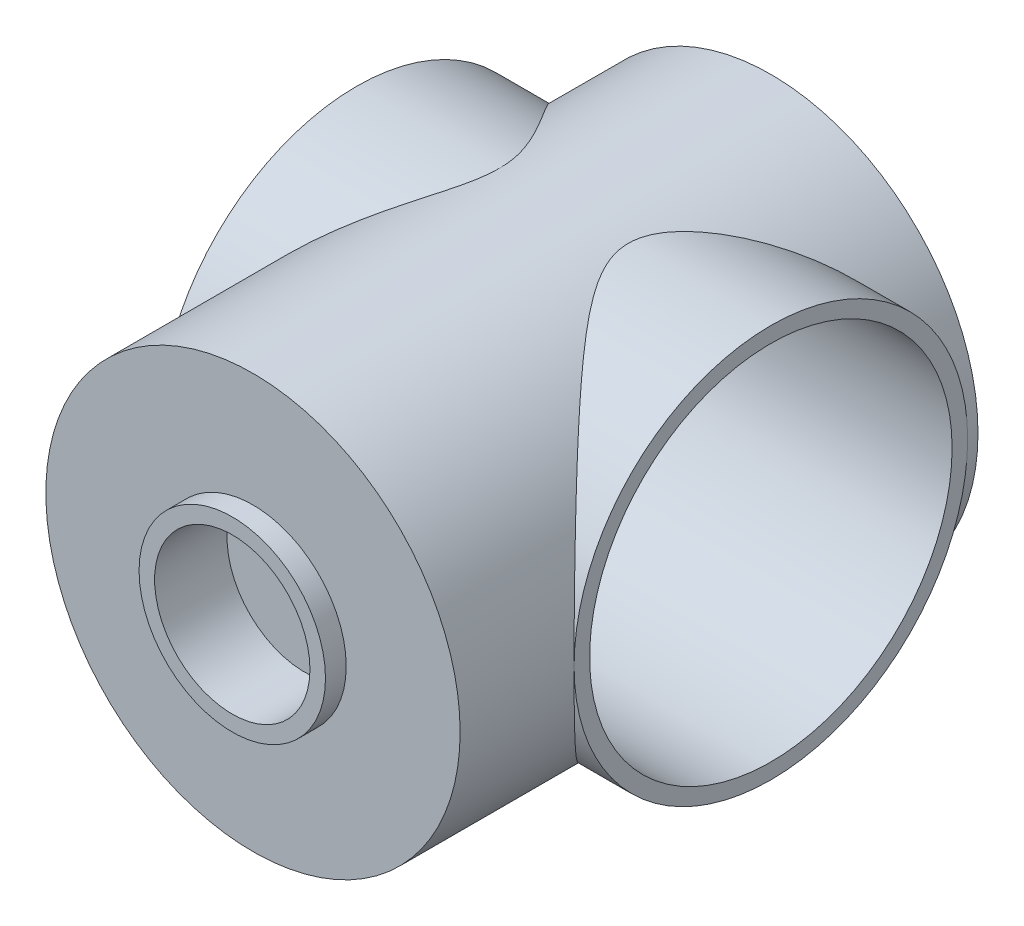
ISO-10303-21;
HEADER;
FILE_DESCRIPTION(('STEP AP214'),'2;1');
FILE_NAME('part.step','',(''),(''),'','','');
FILE_SCHEMA(('AUTOMOTIVE_DESIGN { 1 0 10303 214 1 1 1 1 }'));
ENDSEC;
DATA;
#1=APPLICATION_CONTEXT('core data for automotive mechanical design processes');
#2=APPLICATION_PROTOCOL_DEFINITION('international standard','automotive_design',2000,#1);
#3=PRODUCT_CONTEXT('',#1,'mechanical');
#4=PRODUCT('Part','Part','',(#3));
#5=PRODUCT_RELATED_PRODUCT_CATEGORY('part','',(#4));
#6=PRODUCT_DEFINITION_FORMATION('','',#4);
#7=PRODUCT_DEFINITION_CONTEXT('part definition',#1,'design');
#8=PRODUCT_DEFINITION('design','',#6,#7);
#9=PRODUCT_DEFINITION_SHAPE('','',#8);
#10=(LENGTH_UNIT() NAMED_UNIT(*) SI_UNIT(.MILLI.,.METRE.));
#11=(NAMED_UNIT(*) PLANE_ANGLE_UNIT() SI_UNIT($,.RADIAN.));
#12=(NAMED_UNIT(*) SI_UNIT($,.STERADIAN.) SOLID_ANGLE_UNIT());
#13=UNCERTAINTY_MEASURE_WITH_UNIT(LENGTH_MEASURE(1.E-05),#10,'distance_accuracy_value','');
#14=(GEOMETRIC_REPRESENTATION_CONTEXT(3) GLOBAL_UNCERTAINTY_ASSIGNED_CONTEXT((#13)) GLOBAL_UNIT_ASSIGNED_CONTEXT((#10,
#11,#12)) REPRESENTATION_CONTEXT('',''));
#15=CARTESIAN_POINT('',(0.,0.,0.));
#16=DIRECTION('',(0.,0.,1.));
#17=DIRECTION('',(1.,0.,0.));
#18=AXIS2_PLACEMENT_3D('',#15,#16,#17);
#19=CARTESIAN_POINT('',(0.,0.,50.));
#20=DIRECTION('',(0.,0.,1.));
#21=DIRECTION('',(1.,0.,0.));
#22=AXIS2_PLACEMENT_3D('',#19,#20,#21);
#23=PLANE('',#22);
#24=CARTESIAN_POINT('',(0.,0.,50.));
#25=DIRECTION('',(0.,0.,1.));
#26=DIRECTION('',(1.,0.,0.));
#27=AXIS2_PLACEMENT_3D('',#24,#25,#26);
#28=CIRCLE('',#27,20.);
#29=CARTESIAN_POINT('',(20.,0.,50.));
#30=VERTEX_POINT('',#29);
#31=EDGE_CURVE('E72',#30,#30,#28,.T.);
#32=ORIENTED_EDGE('',*,*,#31,.T.);
#33=EDGE_LOOP('',(#32));
#34=FACE_BOUND('',#33,.T.);
#35=CARTESIAN_POINT('',(0.,0.,50.));
#36=DIRECTION('',(0.,0.,1.));
#37=DIRECTION('',(1.,0.,0.));
#38=AXIS2_PLACEMENT_3D('',#35,#36,#37);
#39=CIRCLE('',#38,9.);
#40=CARTESIAN_POINT('',(9.,0.,50.));
#41=VERTEX_POINT('',#40);
#42=EDGE_CURVE('E120',#41,#41,#39,.T.);
#43=ORIENTED_EDGE('',*,*,#42,.F.);
#44=EDGE_LOOP('',(#43));
#45=FACE_BOUND('',#44,.T.);
#46=ADVANCED_FACE('F34',(#34,#45),#23,.T.);
#47=CARTESIAN_POINT('',(0.,0.,50.));
#48=DIRECTION('',(0.,0.,-1.));
#49=DIRECTION('',(-1.,0.,0.));
#50=AXIS2_PLACEMENT_3D('',#47,#48,#49);
#51=CYLINDRICAL_SURFACE('',#50,20.);
#52=ORIENTED_EDGE('',*,*,#31,.F.);
#53=EDGE_LOOP('',(#52));
#54=FACE_BOUND('',#53,.T.);
#55=CARTESIAN_POINT('',(0.,0.,0.));
#56=DIRECTION('',(0.,0.,1.));
#57=DIRECTION('',(1.,0.,0.));
#58=AXIS2_PLACEMENT_3D('',#55,#56,#57);
#59=CIRCLE('',#58,20.);
#60=CARTESIAN_POINT('',(20.,0.,0.));
#61=VERTEX_POINT('',#60);
#62=EDGE_CURVE('E87',#61,#61,#59,.T.);
#63=ORIENTED_EDGE('',*,*,#62,.T.);
#64=EDGE_LOOP('',(#63));
#65=FACE_BOUND('',#64,.T.);
#66=CARTESIAN_POINT('',(-20.,0.,39.));
#67=CARTESIAN_POINT('',(-19.9999955626947,0.431491780336923,38.9999955365426));
#68=CARTESIAN_POINT('',(-19.9860020525691,0.863147731372778,38.9852670408654));
#69=CARTESIAN_POINT('',(-19.9303160133966,1.72288249530529,38.9266367353864));
#70=CARTESIAN_POINT('',(-19.8886036299503,2.15095852127256,38.8827140144188));
#71=CARTESIAN_POINT('',(-19.7782456960244,3.00084365094373,38.7664418254127));
#72=CARTESIAN_POINT('',(-19.7095313792502,3.4226338771526,38.694019776966));
#73=CARTESIAN_POINT('',(-19.5466227252877,4.25554070477914,38.5221814676467));
#74=CARTESIAN_POINT('',(-19.452432404885,4.66665897764724,38.4227694622545));
#75=CARTESIAN_POINT('',(-19.2411505331243,5.47270235958875,38.1995374101707));
#76=CARTESIAN_POINT('',(-19.1242309553045,5.86772367583815,38.075900600334));
#77=CARTESIAN_POINT('',(-18.8690493944193,6.64269791054437,37.8057012553895));
#78=CARTESIAN_POINT('',(-18.7307870565182,7.02265057834426,37.6591383391215));
#79=CARTESIAN_POINT('',(-18.4350755644304,7.76581302243495,37.3451663155682));
#80=CARTESIAN_POINT('',(-18.2776362250254,8.12903123331093,37.1777678709474));
#81=CARTESIAN_POINT('',(-17.9455657102411,8.83798505092861,36.8240020600647));
#82=CARTESIAN_POINT('',(-17.7709305819572,9.18371661012584,36.637630331959));
#83=CARTESIAN_POINT('',(-17.3321963745199,9.99425935286073,36.1683193528584));
#84=CARTESIAN_POINT('',(-17.0606356874068,10.4501978396039,35.8769725237249));
#85=CARTESIAN_POINT('',(-16.4926208286161,11.3254531798212,35.2649770432841));
#86=CARTESIAN_POINT('',(-16.1961575363809,11.744756499981,34.9443176524478));
#87=CARTESIAN_POINT('',(-15.5822553585074,12.5478859153481,34.2766940778457));
#88=CARTESIAN_POINT('',(-15.2647604973241,12.9316102321683,33.9296593025642));
#89=CARTESIAN_POINT('',(-14.6139588542951,13.6627901165271,33.2132563494675));
#90=CARTESIAN_POINT('',(-14.2806533656126,14.0102486428586,32.8438899974928));
#91=CARTESIAN_POINT('',(-13.4980599317806,14.7710647860523,31.968604711588));
#92=CARTESIAN_POINT('',(-13.0445525232582,15.1719499861228,31.4555495181453));
#93=CARTESIAN_POINT('',(-12.3560099495225,15.729477178637,30.6624567811963));
#94=CARTESIAN_POINT('',(-12.124999387501,15.9080968451658,30.3940358421371));
#95=CARTESIAN_POINT('',(-11.6614867272475,16.2509310992492,29.8494056061317));
#96=CARTESIAN_POINT('',(-11.4289847881397,16.4151471970516,29.5731971297497));
#97=CARTESIAN_POINT('',(-10.964299248433,16.7290955950436,29.0133348216634));
#98=CARTESIAN_POINT('',(-10.7321157546591,16.8788513183511,28.7296940099492));
#99=CARTESIAN_POINT('',(-10.2694108226552,17.1642960310914,28.1541479271954));
#100=CARTESIAN_POINT('',(-10.0388891994241,17.2999866094915,27.8622435944558));
#101=CARTESIAN_POINT('',(-9.58188431794718,17.5572256522996,27.2696681617469));
#102=CARTESIAN_POINT('',(-9.35539744823896,17.678787363951,26.9690056098158));
#103=CARTESIAN_POINT('',(-8.90921150712869,17.9077839763614,26.3575070704172));
#104=CARTESIAN_POINT('',(-8.68951061176511,18.0152226988826,26.0466738637402));
#105=CARTESIAN_POINT('',(-8.32483312065388,18.1858409373182,25.5072350493266));
#106=CARTESIAN_POINT('',(-8.17706864116887,18.2526793789377,25.2816731805062));
#107=CARTESIAN_POINT('',(-7.88903476875587,18.3790052848132,24.823755001084));
#108=CARTESIAN_POINT('',(-7.74876574653403,18.4384923856812,24.5913983553077));
#109=CARTESIAN_POINT('',(-7.47862220761441,18.549703787456,24.119132281495));
#110=CARTESIAN_POINT('',(-7.34873790872973,18.6014354350162,23.8792302651441));
#111=CARTESIAN_POINT('',(-7.10304300701827,18.6966346002582,23.3908434341785));
#112=CARTESIAN_POINT('',(-6.987227911642,18.7401047584979,23.1423613920407));
#113=CARTESIAN_POINT('',(-6.73116046914122,18.8339276507809,22.5323894352116));
#114=CARTESIAN_POINT('',(-6.60015139095238,18.8798789374937,22.1660719666979));
#115=CARTESIAN_POINT('',(-6.44523813286309,18.9330910047483,21.6041822399842));
#116=CARTESIAN_POINT('',(-6.40055965556361,18.9482013479685,21.415027681731));
#117=CARTESIAN_POINT('',(-6.32714498514148,18.9728420801734,21.0333320519043));
#118=CARTESIAN_POINT('',(-6.29839957721119,18.9823756946071,20.8407930043535));
#119=CARTESIAN_POINT('',(-6.25826272746284,18.9956473217775,20.4514038332317));
#120=CARTESIAN_POINT('',(-6.24707838692729,18.9993161792099,20.2545296280974));
#121=CARTESIAN_POINT('',(-6.24344815536585,19.0005094348146,19.8605933668098));
#122=CARTESIAN_POINT('',(-6.2510015795356,18.9980340575386,19.6635313177847));
#123=CARTESIAN_POINT('',(-6.28436887459807,18.9870220507122,19.2708643608755));
#124=CARTESIAN_POINT('',(-6.31020975456215,18.9784764558788,19.0752620412224));
#125=CARTESIAN_POINT('',(-6.37860536732635,18.9555975531279,18.6873222361308));
#126=CARTESIAN_POINT('',(-6.42116726928217,18.9412617625837,18.4949861880594));
#127=CARTESIAN_POINT('',(-6.53688663702237,18.9016915933702,18.0532497232665));
#128=CARTESIAN_POINT('',(-6.61548509550376,18.8744331018855,17.8054636103452));
#129=CARTESIAN_POINT('',(-6.79263721734027,18.8114031770555,17.3182935673287));
#130=CARTESIAN_POINT('',(-6.89120132059925,18.7756272882967,17.0789141101741));
#131=CARTESIAN_POINT('',(-7.10386854353649,18.6962023931897,16.6074513424638));
#132=CARTESIAN_POINT('',(-7.2180309635832,18.6525231243572,16.3754002503381));
#133=CARTESIAN_POINT('',(-7.45773808654807,18.5579834940307,15.9188747865672));
#134=CARTESIAN_POINT('',(-7.58328135715022,18.5071240357385,15.6943994663536));
#135=CARTESIAN_POINT('',(-7.85859101160468,18.392047588408,15.2252977570195));
#136=CARTESIAN_POINT('',(-8.00944842967585,18.326958657164,14.9815300391847));
#137=CARTESIAN_POINT('',(-8.31881696736144,18.1886236221388,14.5012340680243));
#138=CARTESIAN_POINT('',(-8.47732995880348,18.1153755176193,14.2647076085589));
#139=CARTESIAN_POINT('',(-8.79989609898047,17.9608972910754,13.7978496054992));
#140=CARTESIAN_POINT('',(-8.96395352112989,17.8796609154876,13.5675230980637));
#141=CARTESIAN_POINT('',(-9.29585502300564,17.7093737996713,13.1125441677526));
#142=CARTESIAN_POINT('',(-9.46369951093905,17.6203222140246,12.8878923621372));
#143=CARTESIAN_POINT('',(-9.97128767096958,17.3413478011671,12.2211678917267));
#144=CARTESIAN_POINT('',(-10.3147760346769,17.1397515301177,11.7867650111133));
#145=CARTESIAN_POINT('',(-11.0041447378659,16.7055379039882,10.9361871117417));
#146=CARTESIAN_POINT('',(-11.3500240806141,16.4729328139066,10.5200049721039));
#147=CARTESIAN_POINT('',(-12.1056665212499,15.9282591758526,9.6262490867704));
#148=CARTESIAN_POINT('',(-12.514911700893,15.6095131734742,9.15227753722595));
#149=CARTESIAN_POINT('',(-13.3230422732813,14.9257145897841,8.22914900232652));
#150=CARTESIAN_POINT('',(-13.7219244450919,14.5606478140978,7.77999968423114));
#151=CARTESIAN_POINT('',(-14.5022373437004,13.7836054332388,6.90985790126682));
#152=CARTESIAN_POINT('',(-14.8836988347649,13.3717173885493,6.48881514169006));
#153=CARTESIAN_POINT('',(-15.6234635684819,12.4993676731332,5.67798601299291));
#154=CARTESIAN_POINT('',(-15.981777420394,12.0389285132407,5.28818530469962));
#155=CARTESIAN_POINT('',(-16.5671550142102,11.2118267783301,4.65462243341938));
#156=CARTESIAN_POINT('',(-16.8017817175408,10.8575111113885,4.40167361598667));
#157=CARTESIAN_POINT('',(-17.2534344037526,10.124439583005,3.9161903280852));
#158=CARTESIAN_POINT('',(-17.4704617145054,9.74568556931206,3.68365431736366));
#159=CARTESIAN_POINT('',(-17.8838265628638,8.96458702502823,3.24179807247915));
#160=CARTESIAN_POINT('',(-18.0801825592216,8.56226404913311,3.03245711703099));
#161=CARTESIAN_POINT('',(-18.4493383940268,7.73479393562446,2.6396256569873));
#162=CARTESIAN_POINT('',(-18.6221417216989,7.30965019184332,2.45613132319299));
#163=CARTESIAN_POINT('',(-18.9160696390686,6.50657014623371,2.14447049797219));
#164=CARTESIAN_POINT('',(-19.0410496200727,6.13165821023849,2.01213937859449));
#165=CARTESIAN_POINT('',(-19.2701299464419,5.36849484302499,1.76981981606892));
#166=CARTESIAN_POINT('',(-19.374234188335,4.98024591707753,1.65982720331339));
#167=CARTESIAN_POINT('',(-19.5598069754924,4.1925638368381,1.46389910611158));
#168=CARTESIAN_POINT('',(-19.6412842662968,3.79313506955891,1.37795432684295));
#169=CARTESIAN_POINT('',(-19.7801611466375,2.98548142313596,1.23153406332566));
#170=CARTESIAN_POINT('',(-19.8375605168389,2.57725646389988,1.17105881108878));
#171=CARTESIAN_POINT('',(-19.927336120246,1.75321677122373,1.07649749890682));
#172=CARTESIAN_POINT('',(-19.9596038110955,1.33737696877768,1.04252590576506));
#173=CARTESIAN_POINT('',(-19.9980294950247,0.503150285476652,1.00207316859114));
#174=CARTESIAN_POINT('',(-20.004187441918,0.0847634001173589,0.995592073187975));
#175=CARTESIAN_POINT('',(-19.990262668043,-0.751066939077849,1.01024996011989));
#176=CARTESIAN_POINT('',(-19.9701809582087,-1.16851042863924,1.03138787837867));
#177=CARTESIAN_POINT('',(-19.904203825706,-1.99904984777821,1.10086117314712));
#178=CARTESIAN_POINT('',(-19.8583091324285,-2.4121458998642,1.14919578116705));
#179=CARTESIAN_POINT('',(-19.7456315651689,-3.20289349973927,1.26793417362557));
#180=CARTESIAN_POINT('',(-19.6804855843089,-3.5810418370531,1.33660923642078));
#181=CARTESIAN_POINT('',(-19.5297006294377,-4.32852813124934,1.49568027562087));
#182=CARTESIAN_POINT('',(-19.4440632400101,-4.69786676695128,1.58607457249773));
#183=CARTESIAN_POINT('',(-19.2535969268354,-5.42592193219382,1.78731075476043));
#184=CARTESIAN_POINT('',(-19.1487643143934,-5.78463640469842,1.89815657029161));
#185=CARTESIAN_POINT('',(-18.9213820395334,-6.48988829554428,2.13886185964699));
#186=CARTESIAN_POINT('',(-18.798828915291,-6.8364233180645,2.26872504871007));
#187=CARTESIAN_POINT('',(-18.4922264286526,-7.63399751501132,2.59407140807505));
#188=CARTESIAN_POINT('',(-18.3015874994118,-8.07961339500685,2.79669516323391));
#189=CARTESIAN_POINT('',(-17.8947364961729,-8.94466718613493,3.23017029204617));
#190=CARTESIAN_POINT('',(-17.6785172083964,-9.36409766167596,3.4610296288862));
#191=CARTESIAN_POINT('',(-17.2238185770224,-10.1762953016222,3.94797401747329));
#192=CARTESIAN_POINT('',(-16.9853066719815,-10.569021969216,4.20409599995945));
#193=CARTESIAN_POINT('',(-16.4897015821027,-11.3267269879119,4.73827727793532));
#194=CARTESIAN_POINT('',(-16.2326079045464,-11.6917046026871,5.01633715515297));
#195=CARTESIAN_POINT('',(-15.6098123347435,-12.5174700794935,5.69302709461283));
#196=CARTESIAN_POINT('',(-15.2376908514869,-12.9668599538144,6.09969127896075));
#197=CARTESIAN_POINT('',(-14.4720521893293,-13.8161788686704,6.94351307264856));
#198=CARTESIAN_POINT('',(-14.0785259266994,-14.2160866705651,7.38068365086782));
#199=CARTESIAN_POINT('',(-13.2760728434757,-14.9682571916649,8.28263468914017));
#200=CARTESIAN_POINT('',(-12.8671230992717,-15.3204451064448,8.74745689086101));
#201=CARTESIAN_POINT('',(-12.0411441935661,-15.9777692300134,9.70209579937648));
#202=CARTESIAN_POINT('',(-11.624117819034,-16.2829213547382,10.1919039764361));
#203=CARTESIAN_POINT('',(-10.8983401336308,-16.7739394394561,11.0659897716226));
#204=CARTESIAN_POINT('',(-10.5896624374029,-16.9701791142817,11.4445473962363));
#205=CARTESIAN_POINT('',(-9.97616956845816,-17.3379329568544,12.2167425512165));
#206=CARTESIAN_POINT('',(-9.67135549563535,-17.5094402218526,12.6103842528578));
#207=CARTESIAN_POINT('',(-9.07222177547451,-17.8272024257341,13.413862222628));
#208=CARTESIAN_POINT('',(-8.77787661900625,-17.9735226389343,13.8236531410117));
#209=CARTESIAN_POINT('',(-8.35076337299311,-18.1738719741231,14.4539392863459));
#210=CARTESIAN_POINT('',(-8.2108316324619,-18.2374508808584,14.6665705419868));
#211=CARTESIAN_POINT('',(-7.93749645692371,-18.3580611385461,15.0977809669818));
#212=CARTESIAN_POINT('',(-7.80409181428992,-18.4150937033343,15.3163590243401));
#213=CARTESIAN_POINT('',(-7.56610350997262,-18.5139946757721,15.7257561007968));
#214=CARTESIAN_POINT('',(-7.46026510773608,-18.5568418114335,15.9156026832706));
#215=CARTESIAN_POINT('',(-7.25664683648654,-18.6374118152723,16.3006002254971));
#216=CARTESIAN_POINT('',(-7.15886722637287,-18.6751345188458,16.4957513553978));
#217=CARTESIAN_POINT('',(-6.88096688402417,-18.7800709192465,17.0895792061654));
#218=CARTESIAN_POINT('',(-6.71592526795604,-18.8391987921105,17.4972229033863));
#219=CARTESIAN_POINT('',(-6.47472524955498,-18.9233109891393,18.2602388243276));
#220=CARTESIAN_POINT('',(-6.38784455455767,-18.9525563164546,18.6115801647608));
#221=CARTESIAN_POINT('',(-6.30065314846764,-18.9816388018336,19.1459974066885));
#222=CARTESIAN_POINT('',(-6.27877790802762,-18.9888688202376,19.3252303027178));
#223=CARTESIAN_POINT('',(-6.25036820409803,-18.9982408061111,19.6850716416511));
#224=CARTESIAN_POINT('',(-6.24383307248328,-19.0003829951766,19.8656800243032));
#225=CARTESIAN_POINT('',(-6.24650840098191,-18.999503450169,20.2272196384919));
#226=CARTESIAN_POINT('',(-6.2557583039819,-18.9964687804164,20.4081505469477));
#227=CARTESIAN_POINT('',(-6.28952888325748,-18.9853132925774,20.7683827360641));
#228=CARTESIAN_POINT('',(-6.31405033024603,-18.977192217794,20.9476839340143));
#229=CARTESIAN_POINT('',(-6.40888540841334,-18.9454676019886,21.4820330538513));
#230=CARTESIAN_POINT('',(-6.50045980278073,-18.9145050219341,21.8329762565482));
#231=CARTESIAN_POINT('',(-6.70673857183564,-18.8422214609441,22.4603650159704));
#232=CARTESIAN_POINT('',(-6.81494598185713,-18.8035247983732,22.7393997156798));
#233=CARTESIAN_POINT('',(-7.05276350185242,-18.7156254282373,23.286657546876));
#234=CARTESIAN_POINT('',(-7.18239161424587,-18.6664138734496,23.554871346327));
#235=CARTESIAN_POINT('',(-7.45748570129963,-18.5582284021877,24.0822753117325));
#236=CARTESIAN_POINT('',(-7.60301325879214,-18.4992160303041,24.3414248610837));
#237=CARTESIAN_POINT('',(-7.90498547741618,-18.3722088838497,24.85085585847));
#238=CARTESIAN_POINT('',(-8.06142749521778,-18.3042162806275,25.101139431734));
#239=CARTESIAN_POINT('',(-8.40844837540451,-18.1477249643344,25.6346779526079));
#240=CARTESIAN_POINT('',(-8.60040784938464,-18.0576930589226,25.9165795722786));
#241=CARTESIAN_POINT('',(-8.99128357015404,-17.8662876939132,26.4716247734222));
#242=CARTESIAN_POINT('',(-9.19020143269647,-17.7649115879888,26.7447662921766));
#243=CARTESIAN_POINT('',(-9.59259325276324,-17.5509010720763,27.2835399564978));
#244=CARTESIAN_POINT('',(-9.79607080076525,-17.4382575293001,27.5491657828512));
#245=CARTESIAN_POINT('',(-10.2055602966632,-17.2018168568153,28.0734219197749));
#246=CARTESIAN_POINT('',(-10.4115725101958,-17.078018549324,28.3320514878838));
#247=CARTESIAN_POINT('',(-11.0311739176037,-16.6898316132631,29.0982267878914));
#248=CARTESIAN_POINT('',(-11.4463592714063,-16.4086345405557,29.5961003200902));
#249=CARTESIAN_POINT('',(-12.2718013071828,-15.8008183958191,30.5670130789421));
#250=CARTESIAN_POINT('',(-12.6820603990046,-15.4742226049162,31.0400648643543));
#251=CARTESIAN_POINT('',(-13.4528020745255,-14.8073153586913,31.917101628861));
#252=CARTESIAN_POINT('',(-13.8143165236304,-14.471239096031,32.3233828554345));
#253=CARTESIAN_POINT('',(-14.3459439184019,-13.937609958642,32.9156341776905));
#254=CARTESIAN_POINT('',(-14.5213914409286,-13.7548000115401,33.1102031288922));
#255=CARTESIAN_POINT('',(-14.8682275429953,-13.3791325450903,33.493362497326));
#256=CARTESIAN_POINT('',(-15.0396145591144,-13.1862712442553,33.681950620921));
#257=CARTESIAN_POINT('',(-15.5459846982652,-12.59333829913,34.2373022928594));
#258=CARTESIAN_POINT('',(-15.8739619359196,-12.1781359328705,34.5945250493811));
#259=CARTESIAN_POINT('',(-16.5057517437839,-11.3070539134074,35.2793072796501));
#260=CARTESIAN_POINT('',(-16.809573964945,-10.8511906619967,35.6068786077195));
#261=CARTESIAN_POINT('',(-17.3116768534436,-10.023710965738,36.1462418415567));
#262=CARTESIAN_POINT('',(-17.516753493699,-9.66131511900694,36.3658817940397));
#263=CARTESIAN_POINT('',(-17.9081728224223,-8.91486843698505,36.7841620144074));
#264=CARTESIAN_POINT('',(-18.0945168298664,-8.53081912930383,36.9828037608394));
#265=CARTESIAN_POINT('',(-18.4457544471163,-7.74212083323584,37.3565530327524));
#266=CARTESIAN_POINT('',(-18.6106545160208,-7.33747809909919,37.5316676453378));
#267=CARTESIAN_POINT('',(-18.9163136539051,-6.50906154123134,37.855806692713));
#268=CARTESIAN_POINT('',(-19.0570768869105,-6.08529103334246,38.00483562783));
#269=CARTESIAN_POINT('',(-19.2938740756464,-5.28170327741978,38.2552730168894));
#270=CARTESIAN_POINT('',(-19.3934144164209,-4.90408501262006,38.3604309715494));
#271=CARTESIAN_POINT('',(-19.5711150471227,-4.13833964629029,38.5480308809128));
#272=CARTESIAN_POINT('',(-19.6492790489993,-3.75021438215542,38.6304767795275));
#273=CARTESIAN_POINT('',(-19.7827301355616,-2.96667867928911,38.7711722260315));
#274=CARTESIAN_POINT('',(-19.838069729993,-2.57128717311431,38.8294773133939));
#275=CARTESIAN_POINT('',(-19.9250797154837,-1.7751994950015,38.9211260436504));
#276=CARTESIAN_POINT('',(-19.9567643453309,-1.37450666220881,38.9544847027319));
#277=CARTESIAN_POINT('',(-19.9842149348351,-0.81084050554222,38.9833835492551));
#278=CARTESIAN_POINT('',(-19.9901312733498,-0.648806846828776,38.9896116382672));
#279=CARTESIAN_POINT('',(-19.9980248306644,-0.324523211350798,38.9979209033307));
#280=CARTESIAN_POINT('',(-20.000001668759,-0.162273215195814,39.0000016785942));
#281=CARTESIAN_POINT('',(-20.,0.,39.));
#282=B_SPLINE_CURVE_WITH_KNOTS('',3,(#66,#67,#68,#69,#70,#71,#72,#73,#74,#75,#76,#77,#78,#79,
#80,#81,#82,#83,#84,#85,#86,#87,#88,#89,#90,#91,#92,#93,#94,#95,#96,#97,#98,#99,#100,#101,#102,
#103,#104,#105,#106,#107,#108,#109,#110,#111,#112,#113,#114,#115,#116,#117,#118,#119,#120,#121,
#122,#123,#124,#125,#126,#127,#128,#129,#130,#131,#132,#133,#134,#135,#136,#137,#138,#139,#140,
#141,#142,#143,#144,#145,#146,#147,#148,#149,#150,#151,#152,#153,#154,#155,#156,#157,#158,#159,
#160,#161,#162,#163,#164,#165,#166,#167,#168,#169,#170,#171,#172,#173,#174,#175,#176,#177,#178,
#179,#180,#181,#182,#183,#184,#185,#186,#187,#188,#189,#190,#191,#192,#193,#194,#195,#196,#197,
#198,#199,#200,#201,#202,#203,#204,#205,#206,#207,#208,#209,#210,#211,#212,#213,#214,#215,#216,
#217,#218,#219,#220,#221,#222,#223,#224,#225,#226,#227,#228,#229,#230,#231,#232,#233,#234,#235,
#236,#237,#238,#239,#240,#241,#242,#243,#244,#245,#246,#247,#248,#249,#250,#251,#252,#253,#254,
#255,#256,#257,#258,#259,#260,#261,#262,#263,#264,#265,#266,#267,#268,#269,#270,#271,#272,#273,
#274,#275,#276,#277,#278,#279,#280,#281),.UNSPECIFIED.,.T.,.F.,(4,2,2,2,2,2,2,2,2,2,2,2,2,2,2,2,
2,2,2,2,2,2,2,2,2,2,2,2,2,2,2,2,2,2,2,2,2,2,2,2,2,2,2,2,2,2,2,2,2,2,2,2,2,2,2,2,2,2,2,2,2,2,2,2,
2,2,2,2,2,2,2,2,2,2,2,2,2,2,2,2,2,2,2,2,2,2,2,2,2,2,2,2,2,2,2,2,2,2,2,2,2,2,2,2,2,2,2,4),(0.,
1.29428699969141,2.58950206848044,3.88803728707233,5.18636788565181,6.47523269652652,
7.7641189378225,9.0523482777063,10.3408744454333,12.154370126942,13.9685329200983,
15.7877348228093,17.6067881873065,19.9837454633073,21.173399641355,22.362928931903,
23.5504978940054,24.7379325475484,25.9242447229696,27.1102352117161,27.9434423979155,
28.7766907543459,29.609144727513,30.4413321805252,31.612274445829,32.1964851788051,
32.7803576830617,33.3710655416704,33.9617518121459,34.5533123033287,35.1451267039793,
35.9279196595501,36.7111229939162,37.4973912876372,38.2835607640239,39.1650957068174,
40.0468472916134,40.9292947297612,41.8118377454999,43.5785909371286,45.3446473822454,
47.4506327189988,49.5572649721631,51.6600204864341,53.7618053049599,55.2442579743712,
56.7265986886712,58.2076042923395,59.6883902524867,60.93744004565,62.1862564819483,
63.4345895644407,64.6829340182367,65.9366405583982,67.1903493162883,68.4440097740306,
69.6976348091963,70.865815633655,72.0339061528412,73.2022213769063,74.3707651485689,
75.9444522176804,77.518584136356,79.095052335534,80.6715623520351,82.8020340240344,
84.9334169857991,87.0681033194595,89.2020657262473,90.780527579114,92.3594291273229,
93.9341751170066,94.7210906553831,95.5078600458083,96.1722145494763,96.8365903880959,
98.1632274203407,99.2478447026625,99.7893228369039,100.330777387095,100.873586879839,
101.41642376891,102.503726247929,103.407827122751,104.312691724259,105.22119446051,
106.129477928796,107.187254623551,108.245278588393,109.304167189762,110.363167725843,
112.481006162207,114.597762519437,116.513855460713,117.472042043858,118.430591752274,
120.343473771531,122.255587631969,123.666715487937,125.077743915836,126.488346340512,
127.898705166259,129.110738223639,130.322560680606,131.531579459644,132.739869898012,
133.226571681586,133.713320496737),.UNSPECIFIED.);
#283=CARTESIAN_POINT('',(-20.,0.,39.));
#284=VERTEX_POINT('',#283);
#285=CARTESIAN_POINT('',(-20.,0.,1.));
#286=VERTEX_POINT('',#285);
#287=EDGE_CURVE('E63',#284,#286,#282,.T.);
#288=ORIENTED_EDGE('',*,*,#287,.F.);
#289=EDGE_CURVE('E58',#286,#284,#282,.T.);
#290=ORIENTED_EDGE('',*,*,#289,.F.);
#291=EDGE_LOOP('',(#288,#290));
#292=FACE_BOUND('',#291,.T.);
#293=CARTESIAN_POINT('',(20.,0.,39.));
#294=CARTESIAN_POINT('',(19.9999955626947,-0.431491780336923,38.9999955365426));
#295=CARTESIAN_POINT('',(19.986002052569,-0.863147731372779,38.9852670408654));
#296=CARTESIAN_POINT('',(19.9303160133966,-1.72288249530529,38.9266367353864));
#297=CARTESIAN_POINT('',(19.8886036299503,-2.15095852127256,38.8827140144188));
#298=CARTESIAN_POINT('',(19.7782456960244,-3.00084365094373,38.7664418254127));
#299=CARTESIAN_POINT('',(19.7095313792502,-3.4226338771526,38.694019776966));
#300=CARTESIAN_POINT('',(19.5466227252877,-4.25554070477914,38.5221814676467));
#301=CARTESIAN_POINT('',(19.452432404885,-4.66665897764724,38.4227694622545));
#302=CARTESIAN_POINT('',(19.2411505331243,-5.47270235958875,38.1995374101707));
#303=CARTESIAN_POINT('',(19.1242309553045,-5.86772367583815,38.075900600334));
#304=CARTESIAN_POINT('',(18.8690493944193,-6.64269791054437,37.8057012553895));
#305=CARTESIAN_POINT('',(18.7307870565182,-7.02265057834427,37.6591383391215));
#306=CARTESIAN_POINT('',(18.4350755644304,-7.76581302243495,37.3451663155682));
#307=CARTESIAN_POINT('',(18.2776362250253,-8.12903123331093,37.1777678709474));
#308=CARTESIAN_POINT('',(17.9455657102411,-8.8379850509286,36.8240020600647));
#309=CARTESIAN_POINT('',(17.7709305819572,-9.18371661012584,36.637630331959));
#310=CARTESIAN_POINT('',(17.3321963745199,-9.99425935286073,36.1683193528584));
#311=CARTESIAN_POINT('',(17.0606356874068,-10.4501978396039,35.8769725237249));
#312=CARTESIAN_POINT('',(16.4926208286161,-11.3254531798212,35.2649770432841));
#313=CARTESIAN_POINT('',(16.1961575363809,-11.744756499981,34.9443176524478));
#314=CARTESIAN_POINT('',(15.5822553585074,-12.5478859153481,34.2766940778457));
#315=CARTESIAN_POINT('',(15.2647604973241,-12.9316102321683,33.9296593025642));
#316=CARTESIAN_POINT('',(14.6139588542951,-13.6627901165271,33.2132563494675));
#317=CARTESIAN_POINT('',(14.2806533656126,-14.0102486428586,32.8438899974928));
#318=CARTESIAN_POINT('',(13.4980599317806,-14.7710647860523,31.968604711588));
#319=CARTESIAN_POINT('',(13.0445525232582,-15.1719499861228,31.4555495181453));
#320=CARTESIAN_POINT('',(12.3560099495225,-15.729477178637,30.6624567811963));
#321=CARTESIAN_POINT('',(12.124999387501,-15.9080968451658,30.3940358421371));
#322=CARTESIAN_POINT('',(11.6614867272475,-16.2509310992492,29.8494056061317));
#323=CARTESIAN_POINT('',(11.4289847881397,-16.4151471970516,29.5731971297497));
#324=CARTESIAN_POINT('',(10.964299248433,-16.7290955950436,29.0133348216634));
#325=CARTESIAN_POINT('',(10.7321157546592,-16.878851318351,28.7296940099492));
#326=CARTESIAN_POINT('',(10.2694108226552,-17.1642960310914,28.1541479271954));
#327=CARTESIAN_POINT('',(10.0388891994241,-17.2999866094915,27.8622435944558));
#328=CARTESIAN_POINT('',(9.58188431794718,-17.5572256522996,27.2696681617469));
#329=CARTESIAN_POINT('',(9.35539744823897,-17.678787363951,26.9690056098158));
#330=CARTESIAN_POINT('',(8.90921150712869,-17.9077839763614,26.3575070704172));
#331=CARTESIAN_POINT('',(8.68951061176511,-18.0152226988826,26.0466738637402));
#332=CARTESIAN_POINT('',(8.32483312065388,-18.1858409373182,25.5072350493266));
#333=CARTESIAN_POINT('',(8.17706864116887,-18.2526793789377,25.2816731805062));
#334=CARTESIAN_POINT('',(7.88903476875587,-18.3790052848132,24.823755001084));
#335=CARTESIAN_POINT('',(7.74876574653403,-18.4384923856812,24.5913983553077));
#336=CARTESIAN_POINT('',(7.47862220761441,-18.549703787456,24.119132281495));
#337=CARTESIAN_POINT('',(7.34873790872973,-18.6014354350162,23.8792302651441));
#338=CARTESIAN_POINT('',(7.10304300701827,-18.6966346002582,23.3908434341785));
#339=CARTESIAN_POINT('',(6.98722791164199,-18.7401047584979,23.1423613920407));
#340=CARTESIAN_POINT('',(6.73116046914122,-18.8339276507809,22.5323894352116));
#341=CARTESIAN_POINT('',(6.60015139095238,-18.8798789374937,22.1660719666979));
#342=CARTESIAN_POINT('',(6.4452381328631,-18.9330910047483,21.6041822399842));
#343=CARTESIAN_POINT('',(6.40055965556361,-18.9482013479685,21.415027681731));
#344=CARTESIAN_POINT('',(6.32714498514148,-18.9728420801734,21.0333320519043));
#345=CARTESIAN_POINT('',(6.29839957721119,-18.9823756946071,20.8407930043535));
#346=CARTESIAN_POINT('',(6.25826272746284,-18.9956473217775,20.4514038332317));
#347=CARTESIAN_POINT('',(6.24707838692729,-18.9993161792099,20.2545296280974));
#348=CARTESIAN_POINT('',(6.24344815536585,-19.0005094348146,19.8605933668098));
#349=CARTESIAN_POINT('',(6.2510015795356,-18.9980340575386,19.6635313177847));
#350=CARTESIAN_POINT('',(6.28436887459807,-18.9870220507122,19.2708643608756));
#351=CARTESIAN_POINT('',(6.31020975456215,-18.9784764558788,19.0752620412225));
#352=CARTESIAN_POINT('',(6.37860536732634,-18.9555975531279,18.6873222361308));
#353=CARTESIAN_POINT('',(6.42116726928215,-18.9412617625837,18.4949861880595));
#354=CARTESIAN_POINT('',(6.53688663702235,-18.9016915933702,18.0532497232665));
#355=CARTESIAN_POINT('',(6.61548509550375,-18.8744331018855,17.8054636103453));
#356=CARTESIAN_POINT('',(6.79263721734026,-18.8114031770556,17.3182935673287));
#357=CARTESIAN_POINT('',(6.89120132059924,-18.7756272882967,17.0789141101742));
#358=CARTESIAN_POINT('',(7.10386854353648,-18.6962023931897,16.6074513424639));
#359=CARTESIAN_POINT('',(7.2180309635832,-18.6525231243572,16.3754002503381));
#360=CARTESIAN_POINT('',(7.45773808654807,-18.5579834940307,15.9188747865673));
#361=CARTESIAN_POINT('',(7.5832813571502,-18.5071240357385,15.6943994663536));
#362=CARTESIAN_POINT('',(7.85859101160467,-18.392047588408,15.2252977570195));
#363=CARTESIAN_POINT('',(8.00944842967584,-18.326958657164,14.9815300391847));
#364=CARTESIAN_POINT('',(8.31881696736144,-18.1886236221388,14.5012340680243));
#365=CARTESIAN_POINT('',(8.47732995880347,-18.1153755176193,14.2647076085589));
#366=CARTESIAN_POINT('',(8.79989609898046,-17.9608972910754,13.7978496054992));
#367=CARTESIAN_POINT('',(8.96395352112987,-17.8796609154876,13.5675230980637));
#368=CARTESIAN_POINT('',(9.29585502300562,-17.7093737996713,13.1125441677526));
#369=CARTESIAN_POINT('',(9.46369951093903,-17.6203222140246,12.8878923621372));
#370=CARTESIAN_POINT('',(9.97128767096956,-17.3413478011671,12.2211678917268));
#371=CARTESIAN_POINT('',(10.3147760346769,-17.1397515301177,11.7867650111133));
#372=CARTESIAN_POINT('',(11.0041447378659,-16.7055379039882,10.9361871117417));
#373=CARTESIAN_POINT('',(11.3500240806141,-16.4729328139067,10.5200049721039));
#374=CARTESIAN_POINT('',(12.1056665212499,-15.9282591758527,9.62624908677042));
#375=CARTESIAN_POINT('',(12.514911700893,-15.6095131734743,9.15227753722598));
#376=CARTESIAN_POINT('',(13.3230422732813,-14.9257145897841,8.22914900232655));
#377=CARTESIAN_POINT('',(13.7219244450919,-14.5606478140978,7.77999968423117));
#378=CARTESIAN_POINT('',(14.5022373437003,-13.7836054332389,6.90985790126684));
#379=CARTESIAN_POINT('',(14.8836988347649,-13.3717173885493,6.48881514169009));
#380=CARTESIAN_POINT('',(15.6234635684819,-12.4993676731332,5.67798601299294));
#381=CARTESIAN_POINT('',(15.981777420394,-12.0389285132407,5.28818530469965));
#382=CARTESIAN_POINT('',(16.5671550142101,-11.2118267783301,4.65462243341941));
#383=CARTESIAN_POINT('',(16.8017817175407,-10.8575111113886,4.4016736159867));
#384=CARTESIAN_POINT('',(17.2534344037526,-10.1244395830051,3.91619032808523));
#385=CARTESIAN_POINT('',(17.4704617145054,-9.74568556931209,3.68365431736369));
#386=CARTESIAN_POINT('',(17.8838265628638,-8.96458702502827,3.24179807247917));
#387=CARTESIAN_POINT('',(18.0801825592215,-8.56226404913315,3.03245711703101));
#388=CARTESIAN_POINT('',(18.4493383940268,-7.7347939356245,2.63962565698731));
#389=CARTESIAN_POINT('',(18.6221417216989,-7.30965019184335,2.456131323193));
#390=CARTESIAN_POINT('',(18.9160696390686,-6.50657014623374,2.1444704979722));
#391=CARTESIAN_POINT('',(19.0410496200727,-6.13165821023852,2.0121393785945));
#392=CARTESIAN_POINT('',(19.2701299464418,-5.36849484302502,1.76981981606893));
#393=CARTESIAN_POINT('',(19.374234188335,-4.98024591707756,1.6598272033134));
#394=CARTESIAN_POINT('',(19.5598069754924,-4.19256383683814,1.46389910611158));
#395=CARTESIAN_POINT('',(19.6412842662967,-3.79313506955895,1.37795432684296));
#396=CARTESIAN_POINT('',(19.7801611466375,-2.98548142313601,1.23153406332567));
#397=CARTESIAN_POINT('',(19.8375605168389,-2.57725646389992,1.17105881108878));
#398=CARTESIAN_POINT('',(19.927336120246,-1.75321677122377,1.07649749890682));
#399=CARTESIAN_POINT('',(19.9596038110955,-1.33737696877772,1.04252590576507));
#400=CARTESIAN_POINT('',(19.9980294950247,-0.503150285476698,1.00207316859115));
#401=CARTESIAN_POINT('',(20.004187441918,-0.0847634001174003,0.995592073187977));
#402=CARTESIAN_POINT('',(19.990262668043,0.751066939077809,1.01024996011989));
#403=CARTESIAN_POINT('',(19.9701809582087,1.1685104286392,1.03138787837866));
#404=CARTESIAN_POINT('',(19.904203825706,1.99904984777816,1.10086117314711));
#405=CARTESIAN_POINT('',(19.8583091324285,2.41214589986416,1.14919578116704));
#406=CARTESIAN_POINT('',(19.7456315651689,3.20289349973924,1.26793417362557));
#407=CARTESIAN_POINT('',(19.6804855843089,3.58104183705307,1.33660923642077));
#408=CARTESIAN_POINT('',(19.5297006294377,4.32852813124931,1.49568027562086));
#409=CARTESIAN_POINT('',(19.4440632400101,4.69786676695125,1.58607457249772));
#410=CARTESIAN_POINT('',(19.2535969268354,5.42592193219379,1.78731075476043));
#411=CARTESIAN_POINT('',(19.1487643143934,5.78463640469839,1.8981565702916));
#412=CARTESIAN_POINT('',(18.9213820395334,6.48988829554425,2.13886185964698));
#413=CARTESIAN_POINT('',(18.798828915291,6.83642331806448,2.26872504871005));
#414=CARTESIAN_POINT('',(18.4922264286526,7.63399751501129,2.59407140807503));
#415=CARTESIAN_POINT('',(18.3015874994119,8.07961339500683,2.7966951632339));
#416=CARTESIAN_POINT('',(17.8947364961729,8.94466718613491,3.23017029204616));
#417=CARTESIAN_POINT('',(17.6785172083964,9.36409766167593,3.46102962888619));
#418=CARTESIAN_POINT('',(17.2238185770224,10.1762953016222,3.94797401747327));
#419=CARTESIAN_POINT('',(16.9853066719815,10.569021969216,4.20409599995944));
#420=CARTESIAN_POINT('',(16.4897015821027,11.3267269879119,4.7382772779353));
#421=CARTESIAN_POINT('',(16.2326079045464,11.6917046026871,5.01633715515294));
#422=CARTESIAN_POINT('',(15.6098123347435,12.5174700794934,5.6930270946128));
#423=CARTESIAN_POINT('',(15.2376908514869,12.9668599538143,6.09969127896072));
#424=CARTESIAN_POINT('',(14.4720521893293,13.8161788686704,6.94351307264853));
#425=CARTESIAN_POINT('',(14.0785259266994,14.2160866705651,7.38068365086779));
#426=CARTESIAN_POINT('',(13.2760728434758,14.9682571916648,8.28263468914013));
#427=CARTESIAN_POINT('',(12.8671230992717,15.3204451064448,8.74745689086097));
#428=CARTESIAN_POINT('',(12.0411441935662,15.9777692300134,9.70209579937644));
#429=CARTESIAN_POINT('',(11.624117819034,16.2829213547382,10.1919039764361));
#430=CARTESIAN_POINT('',(10.8983401336309,16.7739394394561,11.0659897716225));
#431=CARTESIAN_POINT('',(10.589662437403,16.9701791142817,11.4445473962363));
#432=CARTESIAN_POINT('',(9.97616956845819,17.3379329568544,12.2167425512165));
#433=CARTESIAN_POINT('',(9.67135549563537,17.5094402218526,12.6103842528577));
#434=CARTESIAN_POINT('',(9.07222177547452,17.827202425734,13.413862222628));
#435=CARTESIAN_POINT('',(8.77787661900626,17.9735226389343,13.8236531410117));
#436=CARTESIAN_POINT('',(8.35076337299313,18.1738719741231,14.4539392863459));
#437=CARTESIAN_POINT('',(8.21083163246191,18.2374508808584,14.6665705419868));
#438=CARTESIAN_POINT('',(7.93749645692372,18.3580611385461,15.0977809669818));
#439=CARTESIAN_POINT('',(7.80409181428992,18.4150937033343,15.3163590243401));
#440=CARTESIAN_POINT('',(7.56610350997262,18.5139946757721,15.7257561007968));
#441=CARTESIAN_POINT('',(7.46026510773608,18.5568418114335,15.9156026832706));
#442=CARTESIAN_POINT('',(7.25664683648655,18.6374118152723,16.3006002254971));
#443=CARTESIAN_POINT('',(7.15886722637287,18.6751345188458,16.4957513553978));
#444=CARTESIAN_POINT('',(6.88096688402416,18.7800709192465,17.0895792061654));
#445=CARTESIAN_POINT('',(6.71592526795603,18.8391987921105,17.4972229033863));
#446=CARTESIAN_POINT('',(6.47472524955498,18.9233109891393,18.2602388243276));
#447=CARTESIAN_POINT('',(6.38784455455768,18.9525563164546,18.6115801647608));
#448=CARTESIAN_POINT('',(6.30065314846765,18.9816388018336,19.1459974066885));
#449=CARTESIAN_POINT('',(6.27877790802762,18.9888688202376,19.3252303027178));
#450=CARTESIAN_POINT('',(6.25036820409803,18.9982408061111,19.6850716416511));
#451=CARTESIAN_POINT('',(6.24383307248327,19.0003829951766,19.8656800243032));
#452=CARTESIAN_POINT('',(6.24650840098191,18.999503450169,20.2272196384919));
#453=CARTESIAN_POINT('',(6.2557583039819,18.9964687804164,20.4081505469477));
#454=CARTESIAN_POINT('',(6.28952888325748,18.9853132925774,20.7683827360641));
#455=CARTESIAN_POINT('',(6.31405033024603,18.977192217794,20.9476839340143));
#456=CARTESIAN_POINT('',(6.40888540841333,18.9454676019886,21.4820330538513));
#457=CARTESIAN_POINT('',(6.50045980278073,18.9145050219341,21.8329762565481));
#458=CARTESIAN_POINT('',(6.70673857183565,18.8422214609441,22.4603650159704));
#459=CARTESIAN_POINT('',(6.81494598185713,18.8035247983732,22.7393997156798));
#460=CARTESIAN_POINT('',(7.05276350185241,18.7156254282373,23.286657546876));
#461=CARTESIAN_POINT('',(7.18239161424586,18.6664138734496,23.554871346327));
#462=CARTESIAN_POINT('',(7.45748570129963,18.5582284021877,24.0822753117325));
#463=CARTESIAN_POINT('',(7.60301325879215,18.4992160303041,24.3414248610837));
#464=CARTESIAN_POINT('',(7.90498547741618,18.3722088838497,24.85085585847));
#465=CARTESIAN_POINT('',(8.06142749521777,18.3042162806275,25.101139431734));
#466=CARTESIAN_POINT('',(8.40844837540449,18.1477249643344,25.6346779526079));
#467=CARTESIAN_POINT('',(8.60040784938462,18.0576930589226,25.9165795722786));
#468=CARTESIAN_POINT('',(8.99128357015403,17.8662876939133,26.4716247734222));
#469=CARTESIAN_POINT('',(9.19020143269645,17.7649115879888,26.7447662921766));
#470=CARTESIAN_POINT('',(9.59259325276321,17.5509010720764,27.2835399564978));
#471=CARTESIAN_POINT('',(9.79607080076522,17.4382575293001,27.5491657828511));
#472=CARTESIAN_POINT('',(10.2055602966632,17.2018168568153,28.0734219197749));
#473=CARTESIAN_POINT('',(10.4115725101958,17.078018549324,28.3320514878838));
#474=CARTESIAN_POINT('',(11.0311739176037,16.6898316132631,29.0982267878914));
#475=CARTESIAN_POINT('',(11.4463592714062,16.4086345405557,29.5961003200902));
#476=CARTESIAN_POINT('',(12.2718013071828,15.8008183958191,30.567013078942));
#477=CARTESIAN_POINT('',(12.6820603990046,15.4742226049162,31.0400648643543));
#478=CARTESIAN_POINT('',(13.4528020745255,14.8073153586914,31.917101628861));
#479=CARTESIAN_POINT('',(13.8143165236303,14.471239096031,32.3233828554345));
#480=CARTESIAN_POINT('',(14.3459439184018,13.937609958642,32.9156341776904));
#481=CARTESIAN_POINT('',(14.5213914409286,13.7548000115402,33.1102031288922));
#482=CARTESIAN_POINT('',(14.8682275429952,13.3791325450904,33.493362497326));
#483=CARTESIAN_POINT('',(15.0396145591144,13.1862712442554,33.681950620921));
#484=CARTESIAN_POINT('',(15.5459846982652,12.5933382991301,34.2373022928594));
#485=CARTESIAN_POINT('',(15.8739619359196,12.1781359328705,34.5945250493811));
#486=CARTESIAN_POINT('',(16.5057517437838,11.3070539134074,35.2793072796501));
#487=CARTESIAN_POINT('',(16.8095739649449,10.8511906619968,35.6068786077195));
#488=CARTESIAN_POINT('',(17.3116768534436,10.023710965738,36.1462418415567));
#489=CARTESIAN_POINT('',(17.516753493699,9.66131511900698,36.3658817940397));
#490=CARTESIAN_POINT('',(17.9081728224223,8.91486843698508,36.7841620144074));
#491=CARTESIAN_POINT('',(18.0945168298664,8.53081912930386,36.9828037608394));
#492=CARTESIAN_POINT('',(18.4457544471163,7.74212083323587,37.3565530327524));
#493=CARTESIAN_POINT('',(18.6106545160208,7.33747809909921,37.5316676453378));
#494=CARTESIAN_POINT('',(18.9163136539051,6.50906154123136,37.855806692713));
#495=CARTESIAN_POINT('',(19.0570768869105,6.08529103334248,38.00483562783));
#496=CARTESIAN_POINT('',(19.2938740756464,5.28170327741981,38.2552730168893));
#497=CARTESIAN_POINT('',(19.3934144164209,4.9040850126201,38.3604309715494));
#498=CARTESIAN_POINT('',(19.5711150471227,4.13833964629032,38.5480308809128));
#499=CARTESIAN_POINT('',(19.6492790489993,3.75021438215546,38.6304767795275));
#500=CARTESIAN_POINT('',(19.7827301355616,2.96667867928914,38.7711722260315));
#501=CARTESIAN_POINT('',(19.838069729993,2.57128717311434,38.8294773133939));
#502=CARTESIAN_POINT('',(19.9250797154837,1.77519949500153,38.9211260436504));
#503=CARTESIAN_POINT('',(19.9567643453309,1.37450666220884,38.9544847027319));
#504=CARTESIAN_POINT('',(19.9842149348351,0.810840505542242,38.9833835492551));
#505=CARTESIAN_POINT('',(19.9901312733498,0.648806846828789,38.9896116382672));
#506=CARTESIAN_POINT('',(19.9980248306644,0.3245232113508,38.9979209033307));
#507=CARTESIAN_POINT('',(20.000001668759,0.162273215195815,39.0000016785942));
#508=CARTESIAN_POINT('',(20.,0.,39.));
#509=B_SPLINE_CURVE_WITH_KNOTS('',3,(#293,#294,#295,#296,#297,#298,#299,#300,#301,#302,#303,
#304,#305,#306,#307,#308,#309,#310,#311,#312,#313,#314,#315,#316,#317,#318,#319,#320,#321,#322,
#323,#324,#325,#326,#327,#328,#329,#330,#331,#332,#333,#334,#335,#336,#337,#338,#339,#340,#341,
#342,#343,#344,#345,#346,#347,#348,#349,#350,#351,#352,#353,#354,#355,#356,#357,#358,#359,#360,
#361,#362,#363,#364,#365,#366,#367,#368,#369,#370,#371,#372,#373,#374,#375,#376,#377,#378,#379,
#380,#381,#382,#383,#384,#385,#386,#387,#388,#389,#390,#391,#392,#393,#394,#395,#396,#397,#398,
#399,#400,#401,#402,#403,#404,#405,#406,#407,#408,#409,#410,#411,#412,#413,#414,#415,#416,#417,
#418,#419,#420,#421,#422,#423,#424,#425,#426,#427,#428,#429,#430,#431,#432,#433,#434,#435,#436,
#437,#438,#439,#440,#441,#442,#443,#444,#445,#446,#447,#448,#449,#450,#451,#452,#453,#454,#455,
#456,#457,#458,#459,#460,#461,#462,#463,#464,#465,#466,#467,#468,#469,#470,#471,#472,#473,#474,
#475,#476,#477,#478,#479,#480,#481,#482,#483,#484,#485,#486,#487,#488,#489,#490,#491,#492,#493,
#494,#495,#496,#497,#498,#499,#500,#501,#502,#503,#504,#505,#506,#507,#508),.UNSPECIFIED.,.T.,
.F.,(4,2,2,2,2,2,2,2,2,2,2,2,2,2,2,2,2,2,2,2,2,2,2,2,2,2,2,2,2,2,2,2,2,2,2,2,2,2,2,2,2,2,2,2,2,
2,2,2,2,2,2,2,2,2,2,2,2,2,2,2,2,2,2,2,2,2,2,2,2,2,2,2,2,2,2,2,2,2,2,2,2,2,2,2,2,2,2,2,2,2,2,2,2,
2,2,2,2,2,2,2,2,2,2,2,2,2,2,4),(0.,1.29428699969141,2.58950206848044,3.88803728707233,
5.18636788565182,6.47523269652652,7.7641189378225,9.05234827770629,10.3408744454333,
12.154370126942,13.9685329200983,15.7877348228094,17.6067881873065,19.9837454633073,
21.173399641355,22.362928931903,23.5504978940054,24.7379325475484,25.9242447229696,
27.1102352117161,27.9434423979155,28.7766907543459,29.609144727513,30.4413321805252,
31.612274445829,32.1964851788051,32.7803576830617,33.3710655416704,33.9617518121458,
34.5533123033287,35.1451267039793,35.92791965955,36.7111229939162,37.4973912876372,
38.2835607640239,39.1650957068174,40.0468472916134,40.9292947297611,41.8118377454999,
43.5785909371285,45.3446473822454,47.4506327189987,49.557264972163,51.660020486434,
53.7618053049598,55.2442579743711,56.7265986886712,58.2076042923395,59.6883902524867,
60.93744004565,62.1862564819483,63.4345895644407,64.6829340182367,65.9366405583982,
67.1903493162883,68.4440097740306,69.6976348091963,70.865815633655,72.0339061528411,
73.2022213769063,74.3707651485689,75.9444522176804,77.5185841363559,79.095052335534,
80.671562352035,82.8020340240343,84.9334169857991,87.0681033194594,89.2020657262472,
90.7805275791139,92.3594291273229,93.9341751170066,94.7210906553831,95.5078600458083,
96.1722145494763,96.8365903880959,98.1632274203407,99.2478447026625,99.7893228369039,
100.330777387095,100.873586879839,101.41642376891,102.503726247928,103.407827122751,
104.312691724259,105.22119446051,106.129477928796,107.187254623551,108.245278588393,
109.304167189762,110.363167725843,112.481006162207,114.597762519437,116.513855460713,
117.472042043858,118.430591752274,120.343473771531,122.255587631969,123.666715487937,
125.077743915836,126.488346340512,127.898705166259,129.110738223639,130.322560680606,
131.531579459644,132.739869898012,133.226571681586,133.713320496737),.UNSPECIFIED.);
#510=CARTESIAN_POINT('',(20.,0.,39.));
#511=VERTEX_POINT('',#510);
#512=CARTESIAN_POINT('',(20.,0.,1.));
#513=VERTEX_POINT('',#512);
#514=EDGE_CURVE('E11',#511,#513,#509,.T.);
#515=ORIENTED_EDGE('',*,*,#514,.F.);
#516=EDGE_CURVE('E39',#513,#511,#509,.T.);
#517=ORIENTED_EDGE('',*,*,#516,.F.);
#518=EDGE_LOOP('',(#515,#517));
#519=FACE_BOUND('',#518,.T.);
#520=ADVANCED_FACE('F36',(#54,#65,#292,#519),#51,.T.);
#521=CARTESIAN_POINT('',(0.,0.,0.));
#522=DIRECTION('',(0.,0.,1.));
#523=DIRECTION('',(1.,0.,0.));
#524=AXIS2_PLACEMENT_3D('',#521,#522,#523);
#525=PLANE('',#524);
#526=ORIENTED_EDGE('',*,*,#62,.F.);
#527=EDGE_LOOP('',(#526));
#528=FACE_BOUND('',#527,.T.);
#529=ADVANCED_FACE('F103',(#528),#525,.F.);
#530=CARTESIAN_POINT('',(-20.,0.,20.));
#531=DIRECTION('',(1.,0.,0.));
#532=DIRECTION('',(0.,0.,-1.));
#533=AXIS2_PLACEMENT_3D('',#530,#531,#532);
#534=PLANE('',#533);
#535=CARTESIAN_POINT('',(-20.,0.,20.));
#536=DIRECTION('',(1.,0.,0.));
#537=DIRECTION('',(0.,0.,-1.));
#538=AXIS2_PLACEMENT_3D('',#535,#536,#537);
#539=CIRCLE('',#538,17.5);
#540=CARTESIAN_POINT('',(-20.,0.,2.5));
#541=VERTEX_POINT('',#540);
#542=EDGE_CURVE('E76',#541,#541,#539,.T.);
#543=ORIENTED_EDGE('',*,*,#542,.T.);
#544=EDGE_LOOP('',(#543));
#545=FACE_BOUND('',#544,.T.);
#546=CARTESIAN_POINT('',(-20.,0.,20.));
#547=DIRECTION('',(1.,0.,0.));
#548=DIRECTION('',(0.,0.,-1.));
#549=AXIS2_PLACEMENT_3D('',#546,#547,#548);
#550=CIRCLE('',#549,19.);
#551=EDGE_CURVE('E70',#284,#286,#550,.T.);
#552=ORIENTED_EDGE('',*,*,#551,.F.);
#553=EDGE_CURVE('E75',#286,#284,#550,.T.);
#554=ORIENTED_EDGE('',*,*,#553,.F.);
#555=EDGE_LOOP('',(#552,#554));
#556=FACE_BOUND('',#555,.T.);
#557=ADVANCED_FACE('F74',(#545,#556),#534,.F.);
#558=CARTESIAN_POINT('',(20.,0.,20.));
#559=DIRECTION('',(-1.,0.,0.));
#560=DIRECTION('',(0.,0.,1.));
#561=AXIS2_PLACEMENT_3D('',#558,#559,#560);
#562=CYLINDRICAL_SURFACE('',#561,19.);
#563=ORIENTED_EDGE('',*,*,#551,.T.);
#564=ORIENTED_EDGE('',*,*,#289,.T.);
#565=EDGE_LOOP('',(#563,#564));
#566=FACE_BOUND('',#565,.T.);
#567=ADVANCED_FACE('F69',(#566),#562,.T.);
#568=ORIENTED_EDGE('',*,*,#553,.T.);
#569=ORIENTED_EDGE('',*,*,#287,.T.);
#570=EDGE_LOOP('',(#568,#569));
#571=FACE_BOUND('',#570,.T.);
#572=ADVANCED_FACE('F78',(#571),#562,.T.);
#573=CARTESIAN_POINT('',(20.,0.,20.));
#574=DIRECTION('',(1.,0.,0.));
#575=DIRECTION('',(0.,0.,-1.));
#576=AXIS2_PLACEMENT_3D('',#573,#574,#575);
#577=CIRCLE('',#576,19.);
#578=EDGE_CURVE('E79',#511,#513,#577,.T.);
#579=ORIENTED_EDGE('',*,*,#578,.F.);
#580=ORIENTED_EDGE('',*,*,#514,.T.);
#581=EDGE_LOOP('',(#579,#580));
#582=FACE_BOUND('',#581,.T.);
#583=ADVANCED_FACE('F92',(#582),#562,.T.);
#584=EDGE_CURVE('E81',#513,#511,#577,.T.);
#585=ORIENTED_EDGE('',*,*,#584,.F.);
#586=ORIENTED_EDGE('',*,*,#516,.T.);
#587=EDGE_LOOP('',(#585,#586));
#588=FACE_BOUND('',#587,.T.);
#589=ADVANCED_FACE('F97',(#588),#562,.T.);
#590=CARTESIAN_POINT('',(20.,0.,20.));
#591=DIRECTION('',(1.,0.,0.));
#592=DIRECTION('',(0.,0.,-1.));
#593=AXIS2_PLACEMENT_3D('',#590,#591,#592);
#594=PLANE('',#593);
#595=CARTESIAN_POINT('',(20.,0.,20.));
#596=DIRECTION('',(1.,0.,0.));
#597=DIRECTION('',(0.,0.,-1.));
#598=AXIS2_PLACEMENT_3D('',#595,#596,#597);
#599=CIRCLE('',#598,17.5);
#600=CARTESIAN_POINT('',(20.,0.,2.5));
#601=VERTEX_POINT('',#600);
#602=EDGE_CURVE('E133',#601,#601,#599,.T.);
#603=ORIENTED_EDGE('',*,*,#602,.F.);
#604=EDGE_LOOP('',(#603));
#605=FACE_BOUND('',#604,.T.);
#606=ORIENTED_EDGE('',*,*,#578,.T.);
#607=ORIENTED_EDGE('',*,*,#584,.T.);
#608=EDGE_LOOP('',(#606,#607));
#609=FACE_BOUND('',#608,.T.);
#610=ADVANCED_FACE('F140',(#605,#609),#594,.T.);
#611=CARTESIAN_POINT('',(-20.,0.,20.));
#612=DIRECTION('',(1.,0.,0.));
#613=DIRECTION('',(0.,0.,-1.));
#614=AXIS2_PLACEMENT_3D('',#611,#612,#613);
#615=CYLINDRICAL_SURFACE('',#614,17.5);
#616=ORIENTED_EDGE('',*,*,#542,.F.);
#617=EDGE_LOOP('',(#616));
#618=FACE_BOUND('',#617,.T.);
#619=ORIENTED_EDGE('',*,*,#602,.T.);
#620=EDGE_LOOP('',(#619));
#621=FACE_BOUND('',#620,.T.);
#622=ADVANCED_FACE('F138',(#618,#621),#615,.F.);
#623=CARTESIAN_POINT('',(0.,0.,52.));
#624=DIRECTION('',(0.,0.,1.));
#625=DIRECTION('',(1.,0.,0.));
#626=AXIS2_PLACEMENT_3D('',#623,#624,#625);
#627=PLANE('',#626);
#628=CARTESIAN_POINT('',(0.,0.,52.));
#629=DIRECTION('',(0.,0.,1.));
#630=DIRECTION('',(1.,0.,0.));
#631=AXIS2_PLACEMENT_3D('',#628,#629,#630);
#632=CIRCLE('',#631,9.);
#633=CARTESIAN_POINT('',(9.,0.,52.));
#634=VERTEX_POINT('',#633);
#635=EDGE_CURVE('E122',#634,#634,#632,.T.);
#636=ORIENTED_EDGE('',*,*,#635,.T.);
#637=EDGE_LOOP('',(#636));
#638=FACE_BOUND('',#637,.T.);
#639=CARTESIAN_POINT('',(0.,0.,52.));
#640=DIRECTION('',(0.,0.,1.));
#641=DIRECTION('',(1.,0.,0.));
#642=AXIS2_PLACEMENT_3D('',#639,#640,#641);
#643=CIRCLE('',#642,7.5);
#644=CARTESIAN_POINT('',(7.5,0.,52.));
#645=VERTEX_POINT('',#644);
#646=EDGE_CURVE('E123',#645,#645,#643,.T.);
#647=ORIENTED_EDGE('',*,*,#646,.F.);
#648=EDGE_LOOP('',(#647));
#649=FACE_BOUND('',#648,.T.);
#650=ADVANCED_FACE('F179',(#638,#649),#627,.T.);
#651=CARTESIAN_POINT('',(0.,0.,52.));
#652=DIRECTION('',(0.,0.,-1.));
#653=DIRECTION('',(-1.,0.,0.));
#654=AXIS2_PLACEMENT_3D('',#651,#652,#653);
#655=CYLINDRICAL_SURFACE('',#654,9.);
#656=ORIENTED_EDGE('',*,*,#635,.F.);
#657=EDGE_LOOP('',(#656));
#658=FACE_BOUND('',#657,.T.);
#659=ORIENTED_EDGE('',*,*,#42,.T.);
#660=EDGE_LOOP('',(#659));
#661=FACE_BOUND('',#660,.T.);
#662=ADVANCED_FACE('F193',(#658,#661),#655,.T.);
#663=CARTESIAN_POINT('',(0.,0.,45.));
#664=DIRECTION('',(0.,0.,1.));
#665=DIRECTION('',(1.,0.,0.));
#666=AXIS2_PLACEMENT_3D('',#663,#664,#665);
#667=PLANE('',#666);
#668=CARTESIAN_POINT('',(0.,0.,45.));
#669=DIRECTION('',(0.,0.,1.));
#670=DIRECTION('',(1.,0.,0.));
#671=AXIS2_PLACEMENT_3D('',#668,#669,#670);
#672=CIRCLE('',#671,7.5);
#673=CARTESIAN_POINT('',(7.5,0.,45.));
#674=VERTEX_POINT('',#673);
#675=EDGE_CURVE('E126',#674,#674,#672,.T.);
#676=ORIENTED_EDGE('',*,*,#675,.T.);
#677=EDGE_LOOP('',(#676));
#678=FACE_BOUND('',#677,.T.);
#679=ADVANCED_FACE('F187',(#678),#667,.T.);
#680=CARTESIAN_POINT('',(0.,0.,45.));
#681=DIRECTION('',(0.,0.,1.));
#682=DIRECTION('',(1.,0.,0.));
#683=AXIS2_PLACEMENT_3D('',#680,#681,#682);
#684=CYLINDRICAL_SURFACE('',#683,7.5);
#685=ORIENTED_EDGE('',*,*,#675,.F.);
#686=EDGE_LOOP('',(#685));
#687=FACE_BOUND('',#686,.T.);
#688=ORIENTED_EDGE('',*,*,#646,.T.);
#689=EDGE_LOOP('',(#688));
#690=FACE_BOUND('',#689,.T.);
#691=ADVANCED_FACE('F192',(#687,#690),#684,.F.);
#692=CLOSED_SHELL('',(#46,#520,#529,#557,#567,#572,#583,#589,#610,#622,#650,#662,#679,#691));
#693=MANIFOLD_SOLID_BREP('B2',#692);
#694=ADVANCED_BREP_SHAPE_REPRESENTATION('',(#18,#693),#14);
#695=SHAPE_DEFINITION_REPRESENTATION(#9,#694);
ENDSEC;
END-ISO-10303-21;
